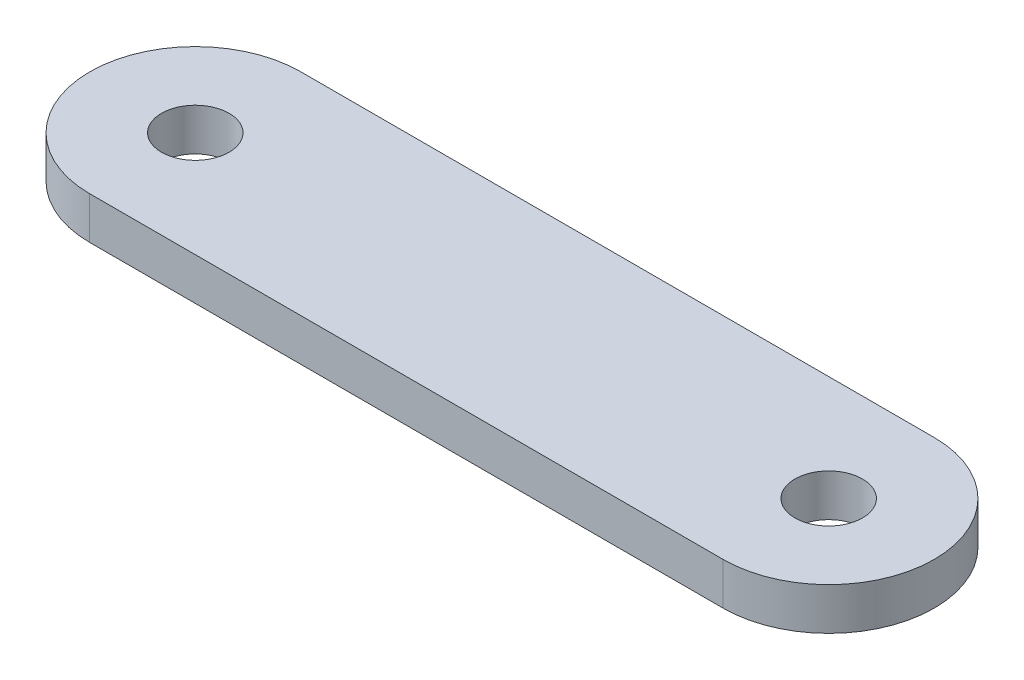
ISO-10303-21;
HEADER;
FILE_DESCRIPTION(('STEP AP214'),'2;1');
FILE_NAME('part.step','',(''),(''),'','','');
FILE_SCHEMA(('AUTOMOTIVE_DESIGN { 1 0 10303 214 1 1 1 1 }'));
ENDSEC;
DATA;
#1=APPLICATION_CONTEXT('core data for automotive mechanical design processes');
#2=APPLICATION_PROTOCOL_DEFINITION('international standard','automotive_design',2000,#1);
#3=PRODUCT_CONTEXT('',#1,'mechanical');
#4=PRODUCT('Part','Part','',(#3));
#5=PRODUCT_RELATED_PRODUCT_CATEGORY('part','',(#4));
#6=PRODUCT_DEFINITION_FORMATION('','',#4);
#7=PRODUCT_DEFINITION_CONTEXT('part definition',#1,'design');
#8=PRODUCT_DEFINITION('design','',#6,#7);
#9=PRODUCT_DEFINITION_SHAPE('','',#8);
#10=(LENGTH_UNIT() NAMED_UNIT(*) SI_UNIT(.MILLI.,.METRE.));
#11=(NAMED_UNIT(*) PLANE_ANGLE_UNIT() SI_UNIT($,.RADIAN.));
#12=(NAMED_UNIT(*) SI_UNIT($,.STERADIAN.) SOLID_ANGLE_UNIT());
#13=UNCERTAINTY_MEASURE_WITH_UNIT(LENGTH_MEASURE(1.E-05),#10,'distance_accuracy_value','');
#14=(GEOMETRIC_REPRESENTATION_CONTEXT(3) GLOBAL_UNCERTAINTY_ASSIGNED_CONTEXT((#13)) GLOBAL_UNIT_ASSIGNED_CONTEXT((#10,
#11,#12)) REPRESENTATION_CONTEXT('',''));
#15=CARTESIAN_POINT('',(0.,0.,0.));
#16=DIRECTION('',(0.,0.,1.));
#17=DIRECTION('',(1.,0.,0.));
#18=AXIS2_PLACEMENT_3D('',#15,#16,#17);
#19=CARTESIAN_POINT('',(-30.,2.,0.));
#20=DIRECTION('',(0.,1.,0.));
#21=DIRECTION('',(0.,0.,1.));
#22=AXIS2_PLACEMENT_3D('',#19,#20,#21);
#23=PLANE('',#22);
#24=CARTESIAN_POINT('',(-30.,2.,0.));
#25=DIRECTION('',(0.,1.,0.));
#26=DIRECTION('',(0.,0.,1.));
#27=AXIS2_PLACEMENT_3D('',#24,#25,#26);
#28=CIRCLE('',#27,1.6);
#29=CARTESIAN_POINT('',(-30.,2.,1.6));
#30=VERTEX_POINT('',#29);
#31=EDGE_CURVE('E102',#30,#30,#28,.T.);
#32=ORIENTED_EDGE('',*,*,#31,.F.);
#33=EDGE_LOOP('',(#32));
#34=FACE_BOUND('',#33,.T.);
#35=CARTESIAN_POINT('',(-30.,2.,0.));
#36=DIRECTION('',(0.,1.,0.));
#37=DIRECTION('',(0.,0.,1.));
#38=AXIS2_PLACEMENT_3D('',#35,#36,#37);
#39=CIRCLE('',#38,5.);
#40=CARTESIAN_POINT('',(-30.,2.,-5.));
#41=VERTEX_POINT('',#40);
#42=CARTESIAN_POINT('',(-30.,2.,5.));
#43=VERTEX_POINT('',#42);
#44=EDGE_CURVE('E87',#41,#43,#39,.T.);
#45=ORIENTED_EDGE('',*,*,#44,.T.);
#46=DIRECTION('',(1.,0.,0.));
#47=VECTOR('',#46,1.);
#48=CARTESIAN_POINT('',(-30.,2.,5.));
#49=LINE('',#48,#47);
#50=CARTESIAN_POINT('',(0.,2.,5.));
#51=VERTEX_POINT('',#50);
#52=EDGE_CURVE('E82',#43,#51,#49,.T.);
#53=ORIENTED_EDGE('',*,*,#52,.T.);
#54=CARTESIAN_POINT('',(0.,2.,0.));
#55=DIRECTION('',(0.,1.,0.));
#56=DIRECTION('',(0.,0.,1.));
#57=AXIS2_PLACEMENT_3D('',#54,#55,#56);
#58=CIRCLE('',#57,5.);
#59=CARTESIAN_POINT('',(0.,2.,-5.));
#60=VERTEX_POINT('',#59);
#61=EDGE_CURVE('E85',#51,#60,#58,.T.);
#62=ORIENTED_EDGE('',*,*,#61,.T.);
#63=DIRECTION('',(-1.,0.,0.));
#64=VECTOR('',#63,1.);
#65=CARTESIAN_POINT('',(-30.,2.,-5.));
#66=LINE('',#65,#64);
#67=EDGE_CURVE('E52',#60,#41,#66,.T.);
#68=ORIENTED_EDGE('',*,*,#67,.T.);
#69=EDGE_LOOP('',(#45,#53,#62,#68));
#70=FACE_BOUND('',#69,.T.);
#71=CARTESIAN_POINT('',(0.,2.,0.));
#72=DIRECTION('',(0.,1.,0.));
#73=DIRECTION('',(0.,0.,1.));
#74=AXIS2_PLACEMENT_3D('',#71,#72,#73);
#75=CIRCLE('',#74,1.6);
#76=CARTESIAN_POINT('',(0.,2.,1.6));
#77=VERTEX_POINT('',#76);
#78=EDGE_CURVE('E117',#77,#77,#75,.T.);
#79=ORIENTED_EDGE('',*,*,#78,.F.);
#80=EDGE_LOOP('',(#79));
#81=FACE_BOUND('',#80,.T.);
#82=ADVANCED_FACE('F35',(#34,#70,#81),#23,.T.);
#83=CARTESIAN_POINT('',(-30.,0.,0.));
#84=DIRECTION('',(0.,1.,0.));
#85=DIRECTION('',(0.,0.,1.));
#86=AXIS2_PLACEMENT_3D('',#83,#84,#85);
#87=PLANE('',#86);
#88=CARTESIAN_POINT('',(-30.,0.,0.));
#89=DIRECTION('',(0.,1.,0.));
#90=DIRECTION('',(0.,0.,1.));
#91=AXIS2_PLACEMENT_3D('',#88,#89,#90);
#92=CIRCLE('',#91,1.6);
#93=CARTESIAN_POINT('',(-30.,0.,1.6));
#94=VERTEX_POINT('',#93);
#95=EDGE_CURVE('E114',#94,#94,#92,.T.);
#96=ORIENTED_EDGE('',*,*,#95,.T.);
#97=EDGE_LOOP('',(#96));
#98=FACE_BOUND('',#97,.T.);
#99=CARTESIAN_POINT('',(-30.,0.,0.));
#100=DIRECTION('',(0.,1.,0.));
#101=DIRECTION('',(0.,0.,1.));
#102=AXIS2_PLACEMENT_3D('',#99,#100,#101);
#103=CIRCLE('',#102,5.);
#104=CARTESIAN_POINT('',(-30.,0.,-5.));
#105=VERTEX_POINT('',#104);
#106=CARTESIAN_POINT('',(-30.,0.,5.));
#107=VERTEX_POINT('',#106);
#108=EDGE_CURVE('E99',#105,#107,#103,.T.);
#109=ORIENTED_EDGE('',*,*,#108,.F.);
#110=DIRECTION('',(-1.,0.,0.));
#111=VECTOR('',#110,1.);
#112=CARTESIAN_POINT('',(-30.,0.,-5.));
#113=LINE('',#112,#111);
#114=CARTESIAN_POINT('',(0.,0.,-5.));
#115=VERTEX_POINT('',#114);
#116=EDGE_CURVE('E75',#115,#105,#113,.T.);
#117=ORIENTED_EDGE('',*,*,#116,.F.);
#118=CARTESIAN_POINT('',(0.,0.,0.));
#119=DIRECTION('',(0.,1.,0.));
#120=DIRECTION('',(0.,0.,1.));
#121=AXIS2_PLACEMENT_3D('',#118,#119,#120);
#122=CIRCLE('',#121,5.);
#123=CARTESIAN_POINT('',(0.,0.,5.));
#124=VERTEX_POINT('',#123);
#125=EDGE_CURVE('E69',#124,#115,#122,.T.);
#126=ORIENTED_EDGE('',*,*,#125,.F.);
#127=DIRECTION('',(1.,0.,0.));
#128=VECTOR('',#127,1.);
#129=CARTESIAN_POINT('',(-30.,0.,5.));
#130=LINE('',#129,#128);
#131=EDGE_CURVE('E91',#107,#124,#130,.T.);
#132=ORIENTED_EDGE('',*,*,#131,.F.);
#133=EDGE_LOOP('',(#109,#117,#126,#132));
#134=FACE_BOUND('',#133,.T.);
#135=CARTESIAN_POINT('',(0.,0.,0.));
#136=DIRECTION('',(0.,1.,0.));
#137=DIRECTION('',(0.,0.,1.));
#138=AXIS2_PLACEMENT_3D('',#135,#136,#137);
#139=CIRCLE('',#138,1.6);
#140=CARTESIAN_POINT('',(0.,0.,1.6));
#141=VERTEX_POINT('',#140);
#142=EDGE_CURVE('E120',#141,#141,#139,.T.);
#143=ORIENTED_EDGE('',*,*,#142,.T.);
#144=EDGE_LOOP('',(#143));
#145=FACE_BOUND('',#144,.T.);
#146=ADVANCED_FACE('F110',(#98,#134,#145),#87,.F.);
#147=CARTESIAN_POINT('',(-30.,2.,0.));
#148=DIRECTION('',(0.,-1.,0.));
#149=DIRECTION('',(0.,0.,-1.));
#150=AXIS2_PLACEMENT_3D('',#147,#148,#149);
#151=CYLINDRICAL_SURFACE('',#150,5.);
#152=ORIENTED_EDGE('',*,*,#108,.T.);
#153=DIRECTION('',(0.,-1.,0.));
#154=VECTOR('',#153,1.);
#155=CARTESIAN_POINT('',(-30.,2.,5.));
#156=LINE('',#155,#154);
#157=EDGE_CURVE('E11',#43,#107,#156,.T.);
#158=ORIENTED_EDGE('',*,*,#157,.F.);
#159=ORIENTED_EDGE('',*,*,#44,.F.);
#160=DIRECTION('',(0.,-1.,0.));
#161=VECTOR('',#160,1.);
#162=CARTESIAN_POINT('',(-30.,2.,-5.));
#163=LINE('',#162,#161);
#164=EDGE_CURVE('E95',#41,#105,#163,.T.);
#165=ORIENTED_EDGE('',*,*,#164,.T.);
#166=EDGE_LOOP('',(#152,#158,#159,#165));
#167=FACE_BOUND('',#166,.T.);
#168=ADVANCED_FACE('F37',(#167),#151,.T.);
#169=CARTESIAN_POINT('',(-30.,2.,5.));
#170=DIRECTION('',(0.,0.,-1.));
#171=DIRECTION('',(-1.,0.,0.));
#172=AXIS2_PLACEMENT_3D('',#169,#170,#171);
#173=PLANE('',#172);
#174=ORIENTED_EDGE('',*,*,#131,.T.);
#175=DIRECTION('',(0.,-1.,0.));
#176=VECTOR('',#175,1.);
#177=CARTESIAN_POINT('',(0.,2.,5.));
#178=LINE('',#177,#176);
#179=EDGE_CURVE('E44',#51,#124,#178,.T.);
#180=ORIENTED_EDGE('',*,*,#179,.F.);
#181=ORIENTED_EDGE('',*,*,#52,.F.);
#182=ORIENTED_EDGE('',*,*,#157,.T.);
#183=EDGE_LOOP('',(#174,#180,#181,#182));
#184=FACE_BOUND('',#183,.T.);
#185=ADVANCED_FACE('F90',(#184),#173,.F.);
#186=CARTESIAN_POINT('',(0.,2.,0.));
#187=DIRECTION('',(0.,-1.,0.));
#188=DIRECTION('',(0.,0.,-1.));
#189=AXIS2_PLACEMENT_3D('',#186,#187,#188);
#190=CYLINDRICAL_SURFACE('',#189,5.);
#191=ORIENTED_EDGE('',*,*,#125,.T.);
#192=DIRECTION('',(0.,-1.,0.));
#193=VECTOR('',#192,1.);
#194=CARTESIAN_POINT('',(0.,2.,-5.));
#195=LINE('',#194,#193);
#196=EDGE_CURVE('E92',#60,#115,#195,.T.);
#197=ORIENTED_EDGE('',*,*,#196,.F.);
#198=ORIENTED_EDGE('',*,*,#61,.F.);
#199=ORIENTED_EDGE('',*,*,#179,.T.);
#200=EDGE_LOOP('',(#191,#197,#198,#199));
#201=FACE_BOUND('',#200,.T.);
#202=ADVANCED_FACE('F93',(#201),#190,.T.);
#203=CARTESIAN_POINT('',(-30.,2.,-5.));
#204=DIRECTION('',(0.,0.,1.));
#205=DIRECTION('',(1.,0.,0.));
#206=AXIS2_PLACEMENT_3D('',#203,#204,#205);
#207=PLANE('',#206);
#208=ORIENTED_EDGE('',*,*,#116,.T.);
#209=ORIENTED_EDGE('',*,*,#164,.F.);
#210=ORIENTED_EDGE('',*,*,#67,.F.);
#211=ORIENTED_EDGE('',*,*,#196,.T.);
#212=EDGE_LOOP('',(#208,#209,#210,#211));
#213=FACE_BOUND('',#212,.T.);
#214=ADVANCED_FACE('F107',(#213),#207,.F.);
#215=CARTESIAN_POINT('',(-30.,2.,0.));
#216=DIRECTION('',(0.,-1.,0.));
#217=DIRECTION('',(0.,0.,-1.));
#218=AXIS2_PLACEMENT_3D('',#215,#216,#217);
#219=CYLINDRICAL_SURFACE('',#218,1.6);
#220=ORIENTED_EDGE('',*,*,#31,.T.);
#221=EDGE_LOOP('',(#220));
#222=FACE_BOUND('',#221,.T.);
#223=ORIENTED_EDGE('',*,*,#95,.F.);
#224=EDGE_LOOP('',(#223));
#225=FACE_BOUND('',#224,.T.);
#226=ADVANCED_FACE('F138',(#222,#225),#219,.F.);
#227=CARTESIAN_POINT('',(0.,2.,0.));
#228=DIRECTION('',(0.,-1.,0.));
#229=DIRECTION('',(0.,0.,-1.));
#230=AXIS2_PLACEMENT_3D('',#227,#228,#229);
#231=CYLINDRICAL_SURFACE('',#230,1.6);
#232=ORIENTED_EDGE('',*,*,#78,.T.);
#233=EDGE_LOOP('',(#232));
#234=FACE_BOUND('',#233,.T.);
#235=ORIENTED_EDGE('',*,*,#142,.F.);
#236=EDGE_LOOP('',(#235));
#237=FACE_BOUND('',#236,.T.);
#238=ADVANCED_FACE('F126',(#234,#237),#231,.F.);
#239=CLOSED_SHELL('',(#82,#146,#168,#185,#202,#214,#226,#238));
#240=MANIFOLD_SOLID_BREP('B2',#239);
#241=ADVANCED_BREP_SHAPE_REPRESENTATION('',(#18,#240),#14);
#242=SHAPE_DEFINITION_REPRESENTATION(#9,#241);
ENDSEC;
END-ISO-10303-21;
